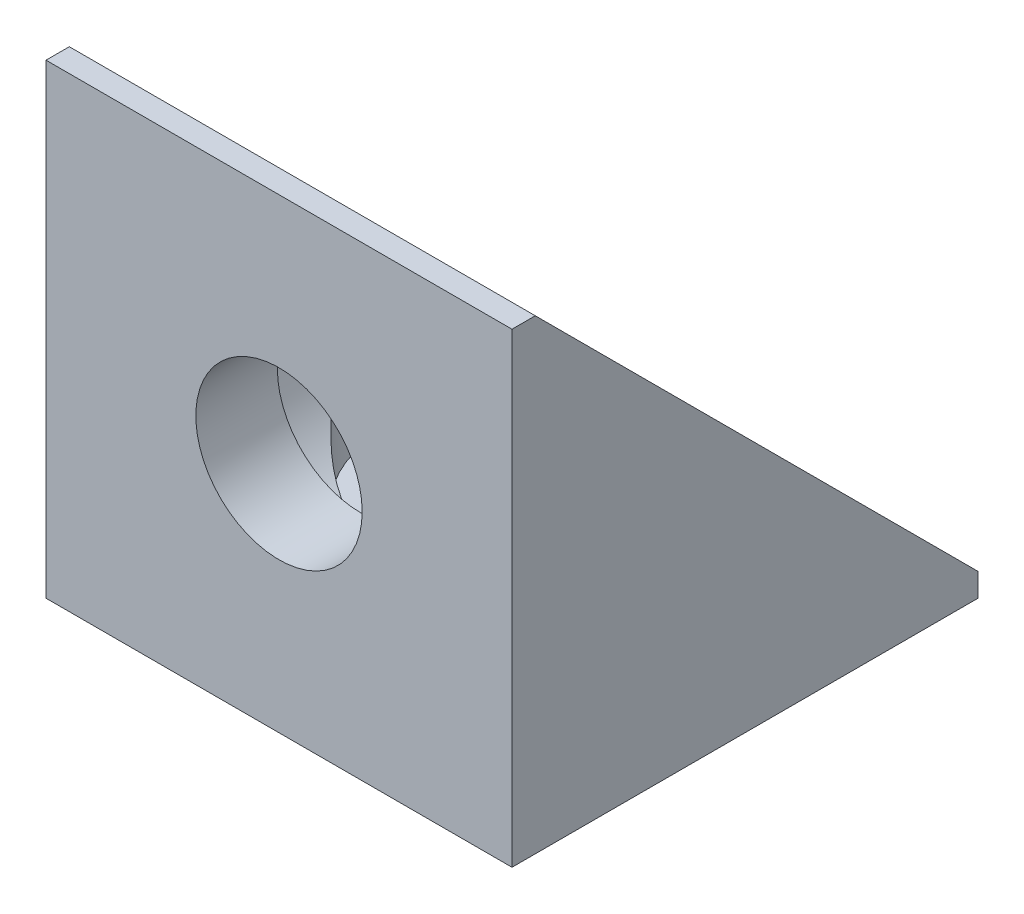
ISO-10303-21;
HEADER;
FILE_DESCRIPTION(('STEP AP214'),'2;1');
FILE_NAME('part.step','',(''),(''),'','','');
FILE_SCHEMA(('AUTOMOTIVE_DESIGN { 1 0 10303 214 1 1 1 1 }'));
ENDSEC;
DATA;
#1=APPLICATION_CONTEXT('core data for automotive mechanical design processes');
#2=APPLICATION_PROTOCOL_DEFINITION('international standard','automotive_design',2000,#1);
#3=PRODUCT_CONTEXT('',#1,'mechanical');
#4=PRODUCT('Part','Part','',(#3));
#5=PRODUCT_RELATED_PRODUCT_CATEGORY('part','',(#4));
#6=PRODUCT_DEFINITION_FORMATION('','',#4);
#7=PRODUCT_DEFINITION_CONTEXT('part definition',#1,'design');
#8=PRODUCT_DEFINITION('design','',#6,#7);
#9=PRODUCT_DEFINITION_SHAPE('','',#8);
#10=(LENGTH_UNIT() NAMED_UNIT(*) SI_UNIT(.MILLI.,.METRE.));
#11=(NAMED_UNIT(*) PLANE_ANGLE_UNIT() SI_UNIT($,.RADIAN.));
#12=(NAMED_UNIT(*) SI_UNIT($,.STERADIAN.) SOLID_ANGLE_UNIT());
#13=UNCERTAINTY_MEASURE_WITH_UNIT(LENGTH_MEASURE(1.E-05),#10,'distance_accuracy_value','');
#14=(GEOMETRIC_REPRESENTATION_CONTEXT(3) GLOBAL_UNCERTAINTY_ASSIGNED_CONTEXT((#13)) GLOBAL_UNIT_ASSIGNED_CONTEXT((#10,
#11,#12)) REPRESENTATION_CONTEXT('',''));
#15=CARTESIAN_POINT('',(0.,0.,0.));
#16=DIRECTION('',(0.,0.,1.));
#17=DIRECTION('',(1.,0.,0.));
#18=AXIS2_PLACEMENT_3D('',#15,#16,#17);
#19=CARTESIAN_POINT('',(0.,-15.556349186104,-10.));
#20=DIRECTION('',(0.,1.,0.));
#21=DIRECTION('',(0.,0.,1.));
#22=AXIS2_PLACEMENT_3D('',#19,#20,#21);
#23=CYLINDRICAL_SURFACE('',#22,5.5);
#24=CARTESIAN_POINT('',(0.,9.99999999999997,-10.));
#25=DIRECTION('',(0.,0.707106781186547,-0.707106781186547));
#26=DIRECTION('',(0.,0.707106781186547,0.707106781186547));
#27=AXIS2_PLACEMENT_3D('',#24,#25,#26);
#28=ELLIPSE('',#27,7.77817459305202,5.5);
#29=CARTESIAN_POINT('',(5.5,9.99999999999997,-10.));
#30=VERTEX_POINT('',#29);
#31=CARTESIAN_POINT('',(-5.5,9.99999999999997,-10.));
#32=VERTEX_POINT('',#31);
#33=EDGE_CURVE('E38',#30,#32,#28,.F.);
#34=ORIENTED_EDGE('',*,*,#33,.T.);
#35=CARTESIAN_POINT('',(0.,9.99999999999997,-10.));
#36=DIRECTION('',(0.,0.707106781186547,0.707106781186547));
#37=DIRECTION('',(0.,0.707106781186547,-0.707106781186547));
#38=AXIS2_PLACEMENT_3D('',#35,#36,#37);
#39=ELLIPSE('',#38,7.77817459305202,5.5);
#40=CARTESIAN_POINT('',(-5.47722557505166,10.4999999999998,-10.5000000000002));
#41=VERTEX_POINT('',#40);
#42=EDGE_CURVE('E12',#32,#41,#39,.F.);
#43=ORIENTED_EDGE('',*,*,#42,.T.);
#44=CARTESIAN_POINT('',(0.,11.,-10.));
#45=DIRECTION('',(0.,-0.707106781186552,0.707106781186543));
#46=DIRECTION('',(0.,0.707106781186543,0.707106781186552));
#47=AXIS2_PLACEMENT_3D('',#44,#45,#46);
#48=ELLIPSE('',#47,7.77817459305198,5.5);
#49=CARTESIAN_POINT('',(5.47722557505166,10.5,-10.5));
#50=VERTEX_POINT('',#49);
#51=EDGE_CURVE('E142',#50,#41,#48,.T.);
#52=ORIENTED_EDGE('',*,*,#51,.F.);
#53=EDGE_CURVE('E44',#50,#30,#39,.F.);
#54=ORIENTED_EDGE('',*,*,#53,.T.);
#55=EDGE_LOOP('',(#34,#43,#52,#54));
#56=FACE_BOUND('',#55,.T.);
#57=ADVANCED_FACE('F34',(#56),#23,.F.);
#58=CARTESIAN_POINT('',(0.,9.99999999999997,-20.));
#59=DIRECTION('',(0.,0.,1.));
#60=DIRECTION('',(1.,0.,0.));
#61=AXIS2_PLACEMENT_3D('',#58,#59,#60);
#62=CYLINDRICAL_SURFACE('',#61,3.57);
#63=CARTESIAN_POINT('',(0.,9.99999999999997,0.));
#64=DIRECTION('',(0.,0.,1.));
#65=DIRECTION('',(1.,0.,0.));
#66=AXIS2_PLACEMENT_3D('',#63,#64,#65);
#67=CIRCLE('',#66,3.57);
#68=CARTESIAN_POINT('',(3.57,9.99999999999997,0.));
#69=VERTEX_POINT('',#68);
#70=EDGE_CURVE('E213',#69,#69,#67,.T.);
#71=ORIENTED_EDGE('',*,*,#70,.T.);
#72=EDGE_LOOP('',(#71));
#73=FACE_BOUND('',#72,.T.);
#74=CARTESIAN_POINT('',(0.,9.99999999999997,-3.5));
#75=DIRECTION('',(0.,0.,-1.));
#76=DIRECTION('',(-1.,0.,0.));
#77=AXIS2_PLACEMENT_3D('',#74,#75,#76);
#78=CIRCLE('',#77,3.57);
#79=CARTESIAN_POINT('',(-3.57,9.99999999999997,-3.5));
#80=VERTEX_POINT('',#79);
#81=EDGE_CURVE('E146',#80,#80,#78,.F.);
#82=ORIENTED_EDGE('',*,*,#81,.F.);
#83=EDGE_LOOP('',(#82));
#84=FACE_BOUND('',#83,.T.);
#85=ADVANCED_FACE('F181',(#73,#84),#62,.F.);
#86=CARTESIAN_POINT('',(0.,19.9999999999999,-10.));
#87=DIRECTION('',(0.,-1.,0.));
#88=DIRECTION('',(0.,0.,-1.));
#89=AXIS2_PLACEMENT_3D('',#86,#87,#88);
#90=CYLINDRICAL_SURFACE('',#89,3.57);
#91=CARTESIAN_POINT('',(0.,0.,-10.));
#92=DIRECTION('',(0.,-1.,0.));
#93=DIRECTION('',(0.,0.,-1.));
#94=AXIS2_PLACEMENT_3D('',#91,#92,#93);
#95=CIRCLE('',#94,3.57);
#96=CARTESIAN_POINT('',(0.,0.,-13.57));
#97=VERTEX_POINT('',#96);
#98=EDGE_CURVE('E127',#97,#97,#95,.T.);
#99=ORIENTED_EDGE('',*,*,#98,.T.);
#100=EDGE_LOOP('',(#99));
#101=FACE_BOUND('',#100,.T.);
#102=CARTESIAN_POINT('',(0.,3.5,-10.));
#103=DIRECTION('',(0.,1.,0.));
#104=DIRECTION('',(0.,0.,1.));
#105=AXIS2_PLACEMENT_3D('',#102,#103,#104);
#106=CIRCLE('',#105,3.57);
#107=CARTESIAN_POINT('',(0.,3.5,-6.43));
#108=VERTEX_POINT('',#107);
#109=EDGE_CURVE('E139',#108,#108,#106,.F.);
#110=ORIENTED_EDGE('',*,*,#109,.F.);
#111=EDGE_LOOP('',(#110));
#112=FACE_BOUND('',#111,.T.);
#113=ADVANCED_FACE('F185',(#101,#112),#90,.F.);
#114=CARTESIAN_POINT('',(10.,1.00000000000015,-20.));
#115=DIRECTION('',(0.,0.,1.));
#116=DIRECTION('',(1.,0.,0.));
#117=AXIS2_PLACEMENT_3D('',#114,#115,#116);
#118=PLANE('',#117);
#119=DIRECTION('',(0.,1.,0.));
#120=VECTOR('',#119,1.);
#121=CARTESIAN_POINT('',(-10.,1.00000000000015,-20.));
#122=LINE('',#121,#120);
#123=CARTESIAN_POINT('',(-10.,0.,-20.));
#124=VERTEX_POINT('',#123);
#125=CARTESIAN_POINT('',(-10.,1.00000000000015,-20.));
#126=VERTEX_POINT('',#125);
#127=EDGE_CURVE('E123',#124,#126,#122,.T.);
#128=ORIENTED_EDGE('',*,*,#127,.T.);
#129=DIRECTION('',(-1.,0.,0.));
#130=VECTOR('',#129,1.);
#131=CARTESIAN_POINT('',(10.,1.00000000000015,-20.));
#132=LINE('',#131,#130);
#133=CARTESIAN_POINT('',(10.,1.00000000000015,-20.));
#134=VERTEX_POINT('',#133);
#135=EDGE_CURVE('E137',#134,#126,#132,.T.);
#136=ORIENTED_EDGE('',*,*,#135,.F.);
#137=DIRECTION('',(0.,1.,0.));
#138=VECTOR('',#137,1.);
#139=CARTESIAN_POINT('',(10.,1.00000000000015,-20.));
#140=LINE('',#139,#138);
#141=CARTESIAN_POINT('',(10.,0.,-20.));
#142=VERTEX_POINT('',#141);
#143=EDGE_CURVE('E133',#142,#134,#140,.T.);
#144=ORIENTED_EDGE('',*,*,#143,.F.);
#145=DIRECTION('',(-1.,0.,0.));
#146=VECTOR('',#145,1.);
#147=CARTESIAN_POINT('',(10.,0.,-20.));
#148=LINE('',#147,#146);
#149=EDGE_CURVE('E119',#142,#124,#148,.T.);
#150=ORIENTED_EDGE('',*,*,#149,.T.);
#151=EDGE_LOOP('',(#128,#136,#144,#150));
#152=FACE_BOUND('',#151,.T.);
#153=ADVANCED_FACE('F36',(#152),#118,.F.);
#154=CARTESIAN_POINT('',(10.,19.9999999999999,-1.));
#155=DIRECTION('',(0.,-0.707106781186552,0.707106781186543));
#156=DIRECTION('',(0.,-0.707106781186543,-0.707106781186552));
#157=AXIS2_PLACEMENT_3D('',#154,#155,#156);
#158=PLANE('',#157);
#159=ORIENTED_EDGE('',*,*,#51,.T.);
#160=CARTESIAN_POINT('',(0.,9.99999999999997,-11.0000000000001));
#161=DIRECTION('',(0.,-0.707106781186552,0.707106781186543));
#162=DIRECTION('',(0.,-0.707106781186543,-0.707106781186552));
#163=AXIS2_PLACEMENT_3D('',#160,#161,#162);
#164=ELLIPSE('',#163,7.77817459305207,5.5);
#165=EDGE_CURVE('E148',#41,#50,#164,.T.);
#166=ORIENTED_EDGE('',*,*,#165,.T.);
#167=EDGE_LOOP('',(#159,#166));
#168=FACE_BOUND('',#167,.T.);
#169=DIRECTION('',(0.,0.707106781186543,0.707106781186552));
#170=VECTOR('',#169,1.);
#171=CARTESIAN_POINT('',(-10.,19.9999999999999,-1.));
#172=LINE('',#171,#170);
#173=CARTESIAN_POINT('',(-10.,19.9999999999999,-1.));
#174=VERTEX_POINT('',#173);
#175=EDGE_CURVE('E126',#126,#174,#172,.T.);
#176=ORIENTED_EDGE('',*,*,#175,.T.);
#177=DIRECTION('',(-1.,0.,0.));
#178=VECTOR('',#177,1.);
#179=CARTESIAN_POINT('',(10.,19.9999999999999,-1.));
#180=LINE('',#179,#178);
#181=CARTESIAN_POINT('',(10.,19.9999999999999,-1.));
#182=VERTEX_POINT('',#181);
#183=EDGE_CURVE('E114',#182,#174,#180,.T.);
#184=ORIENTED_EDGE('',*,*,#183,.F.);
#185=DIRECTION('',(0.,0.707106781186543,0.707106781186552));
#186=VECTOR('',#185,1.);
#187=CARTESIAN_POINT('',(10.,19.9999999999999,-1.));
#188=LINE('',#187,#186);
#189=EDGE_CURVE('E92',#134,#182,#188,.T.);
#190=ORIENTED_EDGE('',*,*,#189,.F.);
#191=ORIENTED_EDGE('',*,*,#135,.T.);
#192=EDGE_LOOP('',(#176,#184,#190,#191));
#193=FACE_BOUND('',#192,.T.);
#194=ADVANCED_FACE('F222',(#168,#193),#158,.F.);
#195=CARTESIAN_POINT('',(10.,19.9999999999999,0.));
#196=DIRECTION('',(0.,-1.,0.));
#197=DIRECTION('',(0.,0.,-1.));
#198=AXIS2_PLACEMENT_3D('',#195,#196,#197);
#199=PLANE('',#198);
#200=DIRECTION('',(0.,0.,1.));
#201=VECTOR('',#200,1.);
#202=CARTESIAN_POINT('',(-10.,19.9999999999999,0.));
#203=LINE('',#202,#201);
#204=CARTESIAN_POINT('',(-10.,19.9999999999999,0.));
#205=VERTEX_POINT('',#204);
#206=EDGE_CURVE('E111',#174,#205,#203,.T.);
#207=ORIENTED_EDGE('',*,*,#206,.T.);
#208=DIRECTION('',(-1.,0.,0.));
#209=VECTOR('',#208,1.);
#210=CARTESIAN_POINT('',(10.,19.9999999999999,0.));
#211=LINE('',#210,#209);
#212=CARTESIAN_POINT('',(10.,19.9999999999999,0.));
#213=VERTEX_POINT('',#212);
#214=EDGE_CURVE('E108',#213,#205,#211,.T.);
#215=ORIENTED_EDGE('',*,*,#214,.F.);
#216=DIRECTION('',(0.,0.,1.));
#217=VECTOR('',#216,1.);
#218=CARTESIAN_POINT('',(10.,19.9999999999999,0.));
#219=LINE('',#218,#217);
#220=EDGE_CURVE('E98',#182,#213,#219,.T.);
#221=ORIENTED_EDGE('',*,*,#220,.F.);
#222=ORIENTED_EDGE('',*,*,#183,.T.);
#223=EDGE_LOOP('',(#207,#215,#221,#222));
#224=FACE_BOUND('',#223,.T.);
#225=ADVANCED_FACE('F109',(#224),#199,.F.);
#226=CARTESIAN_POINT('',(10.,0.,0.));
#227=DIRECTION('',(0.,0.,-1.));
#228=DIRECTION('',(-1.,0.,0.));
#229=AXIS2_PLACEMENT_3D('',#226,#227,#228);
#230=PLANE('',#229);
#231=ORIENTED_EDGE('',*,*,#70,.F.);
#232=EDGE_LOOP('',(#231));
#233=FACE_BOUND('',#232,.T.);
#234=DIRECTION('',(0.,-1.,0.));
#235=VECTOR('',#234,1.);
#236=CARTESIAN_POINT('',(-10.,0.,0.));
#237=LINE('',#236,#235);
#238=CARTESIAN_POINT('',(-10.,0.,0.));
#239=VERTEX_POINT('',#238);
#240=EDGE_CURVE('E130',#205,#239,#237,.T.);
#241=ORIENTED_EDGE('',*,*,#240,.T.);
#242=DIRECTION('',(-1.,0.,0.));
#243=VECTOR('',#242,1.);
#244=CARTESIAN_POINT('',(10.,0.,0.));
#245=LINE('',#244,#243);
#246=CARTESIAN_POINT('',(10.,0.,0.));
#247=VERTEX_POINT('',#246);
#248=EDGE_CURVE('E115',#247,#239,#245,.T.);
#249=ORIENTED_EDGE('',*,*,#248,.F.);
#250=DIRECTION('',(0.,-1.,0.));
#251=VECTOR('',#250,1.);
#252=CARTESIAN_POINT('',(10.,0.,0.));
#253=LINE('',#252,#251);
#254=EDGE_CURVE('E102',#213,#247,#253,.T.);
#255=ORIENTED_EDGE('',*,*,#254,.F.);
#256=ORIENTED_EDGE('',*,*,#214,.T.);
#257=EDGE_LOOP('',(#241,#249,#255,#256));
#258=FACE_BOUND('',#257,.T.);
#259=ADVANCED_FACE('F117',(#233,#258),#230,.F.);
#260=CARTESIAN_POINT('',(10.,0.,-20.));
#261=DIRECTION('',(0.,1.,0.));
#262=DIRECTION('',(0.,0.,1.));
#263=AXIS2_PLACEMENT_3D('',#260,#261,#262);
#264=PLANE('',#263);
#265=ORIENTED_EDGE('',*,*,#98,.F.);
#266=EDGE_LOOP('',(#265));
#267=FACE_BOUND('',#266,.T.);
#268=DIRECTION('',(0.,0.,-1.));
#269=VECTOR('',#268,1.);
#270=CARTESIAN_POINT('',(-10.,0.,-20.));
#271=LINE('',#270,#269);
#272=EDGE_CURVE('E83',#239,#124,#271,.T.);
#273=ORIENTED_EDGE('',*,*,#272,.T.);
#274=ORIENTED_EDGE('',*,*,#149,.F.);
#275=DIRECTION('',(0.,0.,-1.));
#276=VECTOR('',#275,1.);
#277=CARTESIAN_POINT('',(10.,0.,-20.));
#278=LINE('',#277,#276);
#279=EDGE_CURVE('E59',#247,#142,#278,.T.);
#280=ORIENTED_EDGE('',*,*,#279,.F.);
#281=ORIENTED_EDGE('',*,*,#248,.T.);
#282=EDGE_LOOP('',(#273,#274,#280,#281));
#283=FACE_BOUND('',#282,.T.);
#284=ADVANCED_FACE('F223',(#267,#283),#264,.F.);
#285=CARTESIAN_POINT('',(10.,0.,-20.));
#286=DIRECTION('',(-1.,0.,0.));
#287=DIRECTION('',(0.,0.,1.));
#288=AXIS2_PLACEMENT_3D('',#285,#286,#287);
#289=PLANE('',#288);
#290=ORIENTED_EDGE('',*,*,#143,.T.);
#291=ORIENTED_EDGE('',*,*,#189,.T.);
#292=ORIENTED_EDGE('',*,*,#220,.T.);
#293=ORIENTED_EDGE('',*,*,#254,.T.);
#294=ORIENTED_EDGE('',*,*,#279,.T.);
#295=EDGE_LOOP('',(#290,#291,#292,#293,#294));
#296=FACE_BOUND('',#295,.T.);
#297=ADVANCED_FACE('F100',(#296),#289,.F.);
#298=CARTESIAN_POINT('',(-10.,0.,-20.));
#299=DIRECTION('',(-1.,0.,0.));
#300=DIRECTION('',(0.,0.,1.));
#301=AXIS2_PLACEMENT_3D('',#298,#299,#300);
#302=PLANE('',#301);
#303=ORIENTED_EDGE('',*,*,#127,.F.);
#304=ORIENTED_EDGE('',*,*,#272,.F.);
#305=ORIENTED_EDGE('',*,*,#240,.F.);
#306=ORIENTED_EDGE('',*,*,#206,.F.);
#307=ORIENTED_EDGE('',*,*,#175,.F.);
#308=EDGE_LOOP('',(#303,#304,#305,#306,#307));
#309=FACE_BOUND('',#308,.T.);
#310=ADVANCED_FACE('F166',(#309),#302,.T.);
#311=CARTESIAN_POINT('',(0.,3.5,-10.));
#312=DIRECTION('',(0.,1.,0.));
#313=DIRECTION('',(0.,0.,1.));
#314=AXIS2_PLACEMENT_3D('',#311,#312,#313);
#315=CIRCLE('',#314,5.5);
#316=CARTESIAN_POINT('',(0.,3.5,-4.5));
#317=VERTEX_POINT('',#316);
#318=EDGE_CURVE('E143',#317,#317,#315,.F.);
#319=ORIENTED_EDGE('',*,*,#318,.T.);
#320=EDGE_LOOP('',(#319));
#321=FACE_BOUND('',#320,.T.);
#322=CARTESIAN_POINT('',(0.,9.99999999999997,-10.));
#323=DIRECTION('',(0.,0.707106781186547,0.707106781186547));
#324=DIRECTION('',(0.,0.707106781186547,-0.707106781186547));
#325=AXIS2_PLACEMENT_3D('',#322,#323,#324);
#326=ELLIPSE('',#325,7.77817459305202,5.5);
#327=EDGE_CURVE('E151',#32,#30,#326,.T.);
#328=ORIENTED_EDGE('',*,*,#327,.T.);
#329=CARTESIAN_POINT('',(0.,9.99999999999997,-10.));
#330=DIRECTION('',(0.,0.707106781186547,-0.707106781186547));
#331=DIRECTION('',(0.,0.707106781186547,0.707106781186547));
#332=AXIS2_PLACEMENT_3D('',#329,#330,#331);
#333=ELLIPSE('',#332,7.77817459305202,5.5);
#334=EDGE_CURVE('E153',#30,#32,#333,.T.);
#335=ORIENTED_EDGE('',*,*,#334,.T.);
#336=EDGE_LOOP('',(#328,#335));
#337=FACE_BOUND('',#336,.T.);
#338=ADVANCED_FACE('F163',(#321,#337),#23,.F.);
#339=CARTESIAN_POINT('',(10.,3.5,-20.));
#340=DIRECTION('',(0.,1.,0.));
#341=DIRECTION('',(0.,0.,1.));
#342=AXIS2_PLACEMENT_3D('',#339,#340,#341);
#343=PLANE('',#342);
#344=ORIENTED_EDGE('',*,*,#318,.F.);
#345=EDGE_LOOP('',(#344));
#346=FACE_BOUND('',#345,.T.);
#347=ORIENTED_EDGE('',*,*,#109,.T.);
#348=EDGE_LOOP('',(#347));
#349=FACE_BOUND('',#348,.T.);
#350=ADVANCED_FACE('F165',(#346,#349),#343,.T.);
#351=CARTESIAN_POINT('',(10.,0.,-3.5));
#352=DIRECTION('',(0.,0.,-1.));
#353=DIRECTION('',(-1.,0.,0.));
#354=AXIS2_PLACEMENT_3D('',#351,#352,#353);
#355=PLANE('',#354);
#356=CARTESIAN_POINT('',(0.,9.99999999999997,-3.5));
#357=DIRECTION('',(0.,0.,-1.));
#358=DIRECTION('',(-1.,0.,0.));
#359=AXIS2_PLACEMENT_3D('',#356,#357,#358);
#360=CIRCLE('',#359,5.5);
#361=CARTESIAN_POINT('',(-5.5,9.99999999999997,-3.5));
#362=VERTEX_POINT('',#361);
#363=EDGE_CURVE('E149',#362,#362,#360,.F.);
#364=ORIENTED_EDGE('',*,*,#363,.F.);
#365=EDGE_LOOP('',(#364));
#366=FACE_BOUND('',#365,.T.);
#367=ORIENTED_EDGE('',*,*,#81,.T.);
#368=EDGE_LOOP('',(#367));
#369=FACE_BOUND('',#368,.T.);
#370=ADVANCED_FACE('F173',(#366,#369),#355,.T.);
#371=CARTESIAN_POINT('',(0.,9.99999999999997,15.556349186104));
#372=DIRECTION('',(0.,0.,-1.));
#373=DIRECTION('',(-1.,0.,0.));
#374=AXIS2_PLACEMENT_3D('',#371,#372,#373);
#375=CYLINDRICAL_SURFACE('',#374,5.5);
#376=ORIENTED_EDGE('',*,*,#363,.T.);
#377=EDGE_LOOP('',(#376));
#378=FACE_BOUND('',#377,.T.);
#379=ORIENTED_EDGE('',*,*,#327,.F.);
#380=ORIENTED_EDGE('',*,*,#33,.F.);
#381=EDGE_LOOP('',(#379,#380));
#382=FACE_BOUND('',#381,.T.);
#383=ADVANCED_FACE('F162',(#378,#382),#375,.F.);
#384=ORIENTED_EDGE('',*,*,#334,.F.);
#385=ORIENTED_EDGE('',*,*,#53,.F.);
#386=ORIENTED_EDGE('',*,*,#165,.F.);
#387=ORIENTED_EDGE('',*,*,#42,.F.);
#388=EDGE_LOOP('',(#384,#385,#386,#387));
#389=FACE_BOUND('',#388,.T.);
#390=ADVANCED_FACE('F195',(#389),#375,.F.);
#391=CLOSED_SHELL('',(#57,#85,#113,#153,#194,#225,#259,#284,#297,#310,#338,#350,#370,#383,#390));
#392=MANIFOLD_SOLID_BREP('B2',#391);
#393=ADVANCED_BREP_SHAPE_REPRESENTATION('',(#18,#392),#14);
#394=SHAPE_DEFINITION_REPRESENTATION(#9,#393);
ENDSEC;
END-ISO-10303-21;
